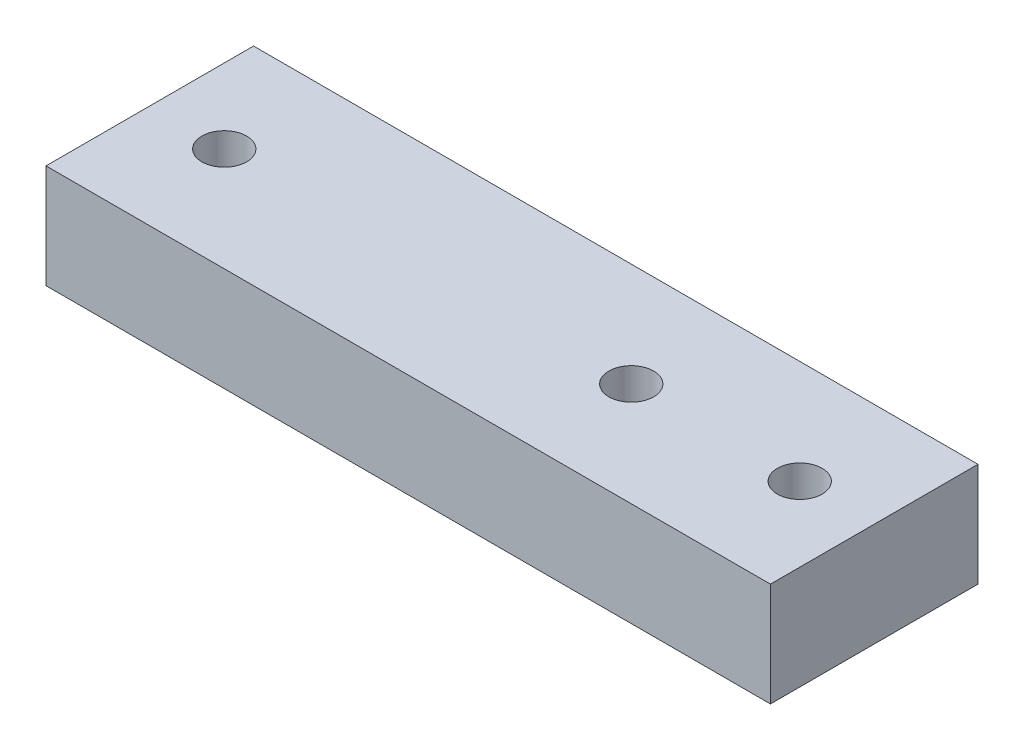
ISO-10303-21;
HEADER;
FILE_DESCRIPTION(('STEP AP214'),'2;1');
FILE_NAME('part.step','',(''),(''),'','','');
FILE_SCHEMA(('AUTOMOTIVE_DESIGN { 1 0 10303 214 1 1 1 1 }'));
ENDSEC;
DATA;
#1=APPLICATION_CONTEXT('core data for automotive mechanical design processes');
#2=APPLICATION_PROTOCOL_DEFINITION('international standard','automotive_design',2000,#1);
#3=PRODUCT_CONTEXT('',#1,'mechanical');
#4=PRODUCT('Part','Part','',(#3));
#5=PRODUCT_RELATED_PRODUCT_CATEGORY('part','',(#4));
#6=PRODUCT_DEFINITION_FORMATION('','',#4);
#7=PRODUCT_DEFINITION_CONTEXT('part definition',#1,'design');
#8=PRODUCT_DEFINITION('design','',#6,#7);
#9=PRODUCT_DEFINITION_SHAPE('','',#8);
#10=(LENGTH_UNIT() NAMED_UNIT(*) SI_UNIT(.MILLI.,.METRE.));
#11=(NAMED_UNIT(*) PLANE_ANGLE_UNIT() SI_UNIT($,.RADIAN.));
#12=(NAMED_UNIT(*) SI_UNIT($,.STERADIAN.) SOLID_ANGLE_UNIT());
#13=UNCERTAINTY_MEASURE_WITH_UNIT(LENGTH_MEASURE(1.E-05),#10,'distance_accuracy_value','');
#14=(GEOMETRIC_REPRESENTATION_CONTEXT(3) GLOBAL_UNCERTAINTY_ASSIGNED_CONTEXT((#13)) GLOBAL_UNIT_ASSIGNED_CONTEXT((#10,
#11,#12)) REPRESENTATION_CONTEXT('',''));
#15=CARTESIAN_POINT('',(0.,0.,0.));
#16=DIRECTION('',(0.,0.,1.));
#17=DIRECTION('',(1.,0.,0.));
#18=AXIS2_PLACEMENT_3D('',#15,#16,#17);
#19=CARTESIAN_POINT('',(0.,12.75,0.));
#20=DIRECTION('',(0.,1.,0.));
#21=DIRECTION('',(0.,0.,1.));
#22=AXIS2_PLACEMENT_3D('',#19,#20,#21);
#23=PLANE('',#22);
#24=CARTESIAN_POINT('',(-9.15,12.75,-12.75));
#25=DIRECTION('',(0.,1.,0.));
#26=DIRECTION('',(0.,0.,1.));
#27=AXIS2_PLACEMENT_3D('',#24,#25,#26);
#28=CIRCLE('',#27,2.75);
#29=CARTESIAN_POINT('',(-9.15,12.75,-9.99999999999999));
#30=VERTEX_POINT('',#29);
#31=EDGE_CURVE('E115',#30,#30,#28,.T.);
#32=ORIENTED_EDGE('',*,*,#31,.F.);
#33=EDGE_LOOP('',(#32));
#34=FACE_BOUND('',#33,.T.);
#35=DIRECTION('',(0.,0.,-1.));
#36=VECTOR('',#35,1.);
#37=CARTESIAN_POINT('',(0.,12.75,0.));
#38=LINE('',#37,#36);
#39=CARTESIAN_POINT('',(0.,12.75,0.));
#40=VERTEX_POINT('',#39);
#41=CARTESIAN_POINT('',(0.,12.75,-25.5));
#42=VERTEX_POINT('',#41);
#43=EDGE_CURVE('E85',#40,#42,#38,.T.);
#44=ORIENTED_EDGE('',*,*,#43,.T.);
#45=DIRECTION('',(-1.,0.,0.));
#46=VECTOR('',#45,1.);
#47=CARTESIAN_POINT('',(0.,12.75,-25.5));
#48=LINE('',#47,#46);
#49=CARTESIAN_POINT('',(-89.,12.75,-25.5));
#50=VERTEX_POINT('',#49);
#51=EDGE_CURVE('E80',#42,#50,#48,.T.);
#52=ORIENTED_EDGE('',*,*,#51,.T.);
#53=DIRECTION('',(0.,0.,1.));
#54=VECTOR('',#53,1.);
#55=CARTESIAN_POINT('',(-89.,12.75,0.));
#56=LINE('',#55,#54);
#57=CARTESIAN_POINT('',(-89.,12.75,0.));
#58=VERTEX_POINT('',#57);
#59=EDGE_CURVE('E83',#50,#58,#56,.T.);
#60=ORIENTED_EDGE('',*,*,#59,.T.);
#61=DIRECTION('',(1.,0.,0.));
#62=VECTOR('',#61,1.);
#63=CARTESIAN_POINT('',(0.,12.75,0.));
#64=LINE('',#63,#62);
#65=EDGE_CURVE('E50',#58,#40,#64,.T.);
#66=ORIENTED_EDGE('',*,*,#65,.T.);
#67=EDGE_LOOP('',(#44,#52,#60,#66));
#68=FACE_BOUND('',#67,.T.);
#69=CARTESIAN_POINT('',(-79.85,12.75,-12.75));
#70=DIRECTION('',(0.,1.,0.));
#71=DIRECTION('',(0.,0.,1.));
#72=AXIS2_PLACEMENT_3D('',#69,#70,#71);
#73=CIRCLE('',#72,2.74999999999999);
#74=CARTESIAN_POINT('',(-79.85,12.75,-10.));
#75=VERTEX_POINT('',#74);
#76=EDGE_CURVE('E100',#75,#75,#73,.T.);
#77=ORIENTED_EDGE('',*,*,#76,.F.);
#78=EDGE_LOOP('',(#77));
#79=FACE_BOUND('',#78,.T.);
#80=CARTESIAN_POINT('',(-29.85,12.75,-12.75));
#81=DIRECTION('',(0.,1.,0.));
#82=DIRECTION('',(0.,0.,1.));
#83=AXIS2_PLACEMENT_3D('',#80,#81,#82);
#84=CIRCLE('',#83,2.75);
#85=CARTESIAN_POINT('',(-29.85,12.75,-10.));
#86=VERTEX_POINT('',#85);
#87=EDGE_CURVE('E121',#86,#86,#84,.T.);
#88=ORIENTED_EDGE('',*,*,#87,.F.);
#89=EDGE_LOOP('',(#88));
#90=FACE_BOUND('',#89,.T.);
#91=ADVANCED_FACE('F33',(#34,#68,#79,#90),#23,.T.);
#92=CARTESIAN_POINT('',(0.,0.,0.));
#93=DIRECTION('',(0.,1.,0.));
#94=DIRECTION('',(0.,0.,1.));
#95=AXIS2_PLACEMENT_3D('',#92,#93,#94);
#96=PLANE('',#95);
#97=DIRECTION('',(0.,0.,-1.));
#98=VECTOR('',#97,1.);
#99=CARTESIAN_POINT('',(0.,0.,0.));
#100=LINE('',#99,#98);
#101=CARTESIAN_POINT('',(0.,0.,0.));
#102=VERTEX_POINT('',#101);
#103=CARTESIAN_POINT('',(0.,0.,-25.5));
#104=VERTEX_POINT('',#103);
#105=EDGE_CURVE('E97',#102,#104,#100,.T.);
#106=ORIENTED_EDGE('',*,*,#105,.F.);
#107=DIRECTION('',(1.,0.,0.));
#108=VECTOR('',#107,1.);
#109=CARTESIAN_POINT('',(0.,0.,0.));
#110=LINE('',#109,#108);
#111=CARTESIAN_POINT('',(-89.,0.,0.));
#112=VERTEX_POINT('',#111);
#113=EDGE_CURVE('E73',#112,#102,#110,.T.);
#114=ORIENTED_EDGE('',*,*,#113,.F.);
#115=DIRECTION('',(0.,0.,1.));
#116=VECTOR('',#115,1.);
#117=CARTESIAN_POINT('',(-89.,0.,0.));
#118=LINE('',#117,#116);
#119=CARTESIAN_POINT('',(-89.,0.,-25.5));
#120=VERTEX_POINT('',#119);
#121=EDGE_CURVE('E67',#120,#112,#118,.T.);
#122=ORIENTED_EDGE('',*,*,#121,.F.);
#123=DIRECTION('',(-1.,0.,0.));
#124=VECTOR('',#123,1.);
#125=CARTESIAN_POINT('',(0.,0.,-25.5));
#126=LINE('',#125,#124);
#127=EDGE_CURVE('E89',#104,#120,#126,.T.);
#128=ORIENTED_EDGE('',*,*,#127,.F.);
#129=EDGE_LOOP('',(#106,#114,#122,#128));
#130=FACE_BOUND('',#129,.T.);
#131=CARTESIAN_POINT('',(-79.85,0.,-12.75));
#132=DIRECTION('',(0.,1.,0.));
#133=DIRECTION('',(0.,0.,1.));
#134=AXIS2_PLACEMENT_3D('',#131,#132,#133);
#135=CIRCLE('',#134,2.74999999999999);
#136=CARTESIAN_POINT('',(-79.85,0.,-10.));
#137=VERTEX_POINT('',#136);
#138=EDGE_CURVE('E112',#137,#137,#135,.T.);
#139=ORIENTED_EDGE('',*,*,#138,.T.);
#140=EDGE_LOOP('',(#139));
#141=FACE_BOUND('',#140,.T.);
#142=CARTESIAN_POINT('',(-9.15,0.,-12.75));
#143=DIRECTION('',(0.,1.,0.));
#144=DIRECTION('',(0.,0.,1.));
#145=AXIS2_PLACEMENT_3D('',#142,#143,#144);
#146=CIRCLE('',#145,2.75);
#147=CARTESIAN_POINT('',(-9.15,0.,-9.99999999999999));
#148=VERTEX_POINT('',#147);
#149=EDGE_CURVE('E118',#148,#148,#146,.T.);
#150=ORIENTED_EDGE('',*,*,#149,.T.);
#151=EDGE_LOOP('',(#150));
#152=FACE_BOUND('',#151,.T.);
#153=CARTESIAN_POINT('',(-29.85,0.,-12.75));
#154=DIRECTION('',(0.,1.,0.));
#155=DIRECTION('',(0.,0.,1.));
#156=AXIS2_PLACEMENT_3D('',#153,#154,#155);
#157=CIRCLE('',#156,2.75);
#158=CARTESIAN_POINT('',(-29.85,0.,-10.));
#159=VERTEX_POINT('',#158);
#160=EDGE_CURVE('E124',#159,#159,#157,.T.);
#161=ORIENTED_EDGE('',*,*,#160,.T.);
#162=EDGE_LOOP('',(#161));
#163=FACE_BOUND('',#162,.T.);
#164=ADVANCED_FACE('F108',(#130,#141,#152,#163),#96,.F.);
#165=CARTESIAN_POINT('',(0.,12.75,0.));
#166=DIRECTION('',(-1.,0.,0.));
#167=DIRECTION('',(0.,0.,1.));
#168=AXIS2_PLACEMENT_3D('',#165,#166,#167);
#169=PLANE('',#168);
#170=ORIENTED_EDGE('',*,*,#105,.T.);
#171=DIRECTION('',(0.,-1.,0.));
#172=VECTOR('',#171,1.);
#173=CARTESIAN_POINT('',(0.,12.75,-25.5));
#174=LINE('',#173,#172);
#175=EDGE_CURVE('E11',#42,#104,#174,.T.);
#176=ORIENTED_EDGE('',*,*,#175,.F.);
#177=ORIENTED_EDGE('',*,*,#43,.F.);
#178=DIRECTION('',(0.,-1.,0.));
#179=VECTOR('',#178,1.);
#180=CARTESIAN_POINT('',(0.,12.75,0.));
#181=LINE('',#180,#179);
#182=EDGE_CURVE('E93',#40,#102,#181,.T.);
#183=ORIENTED_EDGE('',*,*,#182,.T.);
#184=EDGE_LOOP('',(#170,#176,#177,#183));
#185=FACE_BOUND('',#184,.T.);
#186=ADVANCED_FACE('F35',(#185),#169,.F.);
#187=CARTESIAN_POINT('',(0.,12.75,-25.5));
#188=DIRECTION('',(0.,0.,1.));
#189=DIRECTION('',(1.,0.,0.));
#190=AXIS2_PLACEMENT_3D('',#187,#188,#189);
#191=PLANE('',#190);
#192=ORIENTED_EDGE('',*,*,#127,.T.);
#193=DIRECTION('',(0.,-1.,0.));
#194=VECTOR('',#193,1.);
#195=CARTESIAN_POINT('',(-89.,12.75,-25.5));
#196=LINE('',#195,#194);
#197=EDGE_CURVE('E42',#50,#120,#196,.T.);
#198=ORIENTED_EDGE('',*,*,#197,.F.);
#199=ORIENTED_EDGE('',*,*,#51,.F.);
#200=ORIENTED_EDGE('',*,*,#175,.T.);
#201=EDGE_LOOP('',(#192,#198,#199,#200));
#202=FACE_BOUND('',#201,.T.);
#203=ADVANCED_FACE('F88',(#202),#191,.F.);
#204=CARTESIAN_POINT('',(-89.,12.75,0.));
#205=DIRECTION('',(1.,0.,0.));
#206=DIRECTION('',(0.,0.,-1.));
#207=AXIS2_PLACEMENT_3D('',#204,#205,#206);
#208=PLANE('',#207);
#209=ORIENTED_EDGE('',*,*,#121,.T.);
#210=DIRECTION('',(0.,-1.,0.));
#211=VECTOR('',#210,1.);
#212=CARTESIAN_POINT('',(-89.,12.75,0.));
#213=LINE('',#212,#211);
#214=EDGE_CURVE('E90',#58,#112,#213,.T.);
#215=ORIENTED_EDGE('',*,*,#214,.F.);
#216=ORIENTED_EDGE('',*,*,#59,.F.);
#217=ORIENTED_EDGE('',*,*,#197,.T.);
#218=EDGE_LOOP('',(#209,#215,#216,#217));
#219=FACE_BOUND('',#218,.T.);
#220=ADVANCED_FACE('F91',(#219),#208,.F.);
#221=CARTESIAN_POINT('',(0.,12.75,0.));
#222=DIRECTION('',(0.,0.,-1.));
#223=DIRECTION('',(-1.,0.,0.));
#224=AXIS2_PLACEMENT_3D('',#221,#222,#223);
#225=PLANE('',#224);
#226=ORIENTED_EDGE('',*,*,#113,.T.);
#227=ORIENTED_EDGE('',*,*,#182,.F.);
#228=ORIENTED_EDGE('',*,*,#65,.F.);
#229=ORIENTED_EDGE('',*,*,#214,.T.);
#230=EDGE_LOOP('',(#226,#227,#228,#229));
#231=FACE_BOUND('',#230,.T.);
#232=ADVANCED_FACE('F105',(#231),#225,.F.);
#233=CARTESIAN_POINT('',(-79.85,12.75,-12.75));
#234=DIRECTION('',(0.,-1.,0.));
#235=DIRECTION('',(0.,0.,-1.));
#236=AXIS2_PLACEMENT_3D('',#233,#234,#235);
#237=CYLINDRICAL_SURFACE('',#236,2.74999999999999);
#238=ORIENTED_EDGE('',*,*,#76,.T.);
#239=EDGE_LOOP('',(#238));
#240=FACE_BOUND('',#239,.T.);
#241=ORIENTED_EDGE('',*,*,#138,.F.);
#242=EDGE_LOOP('',(#241));
#243=FACE_BOUND('',#242,.T.);
#244=ADVANCED_FACE('F142',(#240,#243),#237,.F.);
#245=CARTESIAN_POINT('',(-9.15,12.75,-12.75));
#246=DIRECTION('',(0.,-1.,0.));
#247=DIRECTION('',(0.,0.,-1.));
#248=AXIS2_PLACEMENT_3D('',#245,#246,#247);
#249=CYLINDRICAL_SURFACE('',#248,2.75);
#250=ORIENTED_EDGE('',*,*,#31,.T.);
#251=EDGE_LOOP('',(#250));
#252=FACE_BOUND('',#251,.T.);
#253=ORIENTED_EDGE('',*,*,#149,.F.);
#254=EDGE_LOOP('',(#253));
#255=FACE_BOUND('',#254,.T.);
#256=ADVANCED_FACE('F188',(#252,#255),#249,.F.);
#257=CARTESIAN_POINT('',(-29.85,12.75,-12.75));
#258=DIRECTION('',(0.,-1.,0.));
#259=DIRECTION('',(0.,0.,-1.));
#260=AXIS2_PLACEMENT_3D('',#257,#258,#259);
#261=CYLINDRICAL_SURFACE('',#260,2.75);
#262=ORIENTED_EDGE('',*,*,#87,.T.);
#263=EDGE_LOOP('',(#262));
#264=FACE_BOUND('',#263,.T.);
#265=ORIENTED_EDGE('',*,*,#160,.F.);
#266=EDGE_LOOP('',(#265));
#267=FACE_BOUND('',#266,.T.);
#268=ADVANCED_FACE('F130',(#264,#267),#261,.F.);
#269=CLOSED_SHELL('',(#91,#164,#186,#203,#220,#232,#244,#256,#268));
#270=MANIFOLD_SOLID_BREP('B2',#269);
#271=ADVANCED_BREP_SHAPE_REPRESENTATION('',(#18,#270),#14);
#272=SHAPE_DEFINITION_REPRESENTATION(#9,#271);
ENDSEC;
END-ISO-10303-21;
